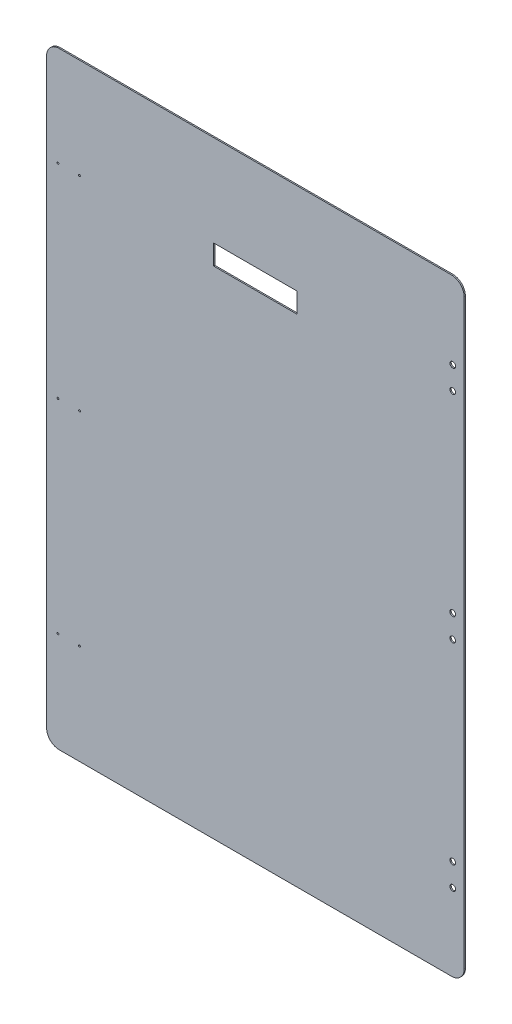
ISO-10303-21;
HEADER;
FILE_DESCRIPTION(('STEP AP214'),'2;1');
FILE_NAME('part.step','',(''),(''),'','','');
FILE_SCHEMA(('AUTOMOTIVE_DESIGN { 1 0 10303 214 1 1 1 1 }'));
ENDSEC;
DATA;
#1=APPLICATION_CONTEXT('core data for automotive mechanical design processes');
#2=APPLICATION_PROTOCOL_DEFINITION('international standard','automotive_design',2000,#1);
#3=PRODUCT_CONTEXT('',#1,'mechanical');
#4=PRODUCT('Part','Part','',(#3));
#5=PRODUCT_RELATED_PRODUCT_CATEGORY('part','',(#4));
#6=PRODUCT_DEFINITION_FORMATION('','',#4);
#7=PRODUCT_DEFINITION_CONTEXT('part definition',#1,'design');
#8=PRODUCT_DEFINITION('design','',#6,#7);
#9=PRODUCT_DEFINITION_SHAPE('','',#8);
#10=(LENGTH_UNIT() NAMED_UNIT(*) SI_UNIT(.MILLI.,.METRE.));
#11=(NAMED_UNIT(*) PLANE_ANGLE_UNIT() SI_UNIT($,.RADIAN.));
#12=(NAMED_UNIT(*) SI_UNIT($,.STERADIAN.) SOLID_ANGLE_UNIT());
#13=UNCERTAINTY_MEASURE_WITH_UNIT(LENGTH_MEASURE(1.E-05),#10,'distance_accuracy_value','');
#14=(GEOMETRIC_REPRESENTATION_CONTEXT(3) GLOBAL_UNCERTAINTY_ASSIGNED_CONTEXT((#13)) GLOBAL_UNIT_ASSIGNED_CONTEXT((#10,
#11,#12)) REPRESENTATION_CONTEXT('',''));
#15=CARTESIAN_POINT('',(0.,0.,0.));
#16=DIRECTION('',(0.,0.,1.));
#17=DIRECTION('',(1.,0.,0.));
#18=AXIS2_PLACEMENT_3D('',#15,#16,#17);
#19=CARTESIAN_POINT('',(-310.,-460.,-2.));
#20=DIRECTION('',(0.,0.,1.));
#21=DIRECTION('',(1.,0.,0.));
#22=AXIS2_PLACEMENT_3D('',#19,#20,#21);
#23=CYLINDRICAL_SURFACE('',#22,20.);
#24=CARTESIAN_POINT('',(-310.,-460.,0.));
#25=DIRECTION('',(0.,0.,1.));
#26=DIRECTION('',(-1.,0.,0.));
#27=AXIS2_PLACEMENT_3D('',#24,#25,#26);
#28=CIRCLE('',#27,20.);
#29=CARTESIAN_POINT('',(-330.,-460.,0.));
#30=VERTEX_POINT('',#29);
#31=CARTESIAN_POINT('',(-310.,-480.,0.));
#32=VERTEX_POINT('',#31);
#33=EDGE_CURVE('E213',#30,#32,#28,.T.);
#34=ORIENTED_EDGE('',*,*,#33,.F.);
#35=DIRECTION('',(0.,0.,1.));
#36=VECTOR('',#35,1.);
#37=CARTESIAN_POINT('',(-330.,-460.,-2.));
#38=LINE('',#37,#36);
#39=CARTESIAN_POINT('',(-330.,-460.,-2.));
#40=VERTEX_POINT('',#39);
#41=EDGE_CURVE('E11',#40,#30,#38,.T.);
#42=ORIENTED_EDGE('',*,*,#41,.F.);
#43=CARTESIAN_POINT('',(-310.,-460.,-2.));
#44=DIRECTION('',(0.,0.,1.));
#45=DIRECTION('',(-1.,0.,0.));
#46=AXIS2_PLACEMENT_3D('',#43,#44,#45);
#47=CIRCLE('',#46,20.);
#48=CARTESIAN_POINT('',(-310.,-480.,-2.));
#49=VERTEX_POINT('',#48);
#50=EDGE_CURVE('E214',#40,#49,#47,.T.);
#51=ORIENTED_EDGE('',*,*,#50,.T.);
#52=DIRECTION('',(0.,0.,1.));
#53=VECTOR('',#52,1.);
#54=CARTESIAN_POINT('',(-310.,-480.,-2.));
#55=LINE('',#54,#53);
#56=EDGE_CURVE('E45',#49,#32,#55,.T.);
#57=ORIENTED_EDGE('',*,*,#56,.T.);
#58=EDGE_LOOP('',(#34,#42,#51,#57));
#59=FACE_BOUND('',#58,.T.);
#60=ADVANCED_FACE('F42',(#59),#23,.T.);
#61=CARTESIAN_POINT('',(-330.,-460.,-2.));
#62=DIRECTION('',(-1.,0.,0.));
#63=DIRECTION('',(0.,0.,1.));
#64=AXIS2_PLACEMENT_3D('',#61,#62,#63);
#65=PLANE('',#64);
#66=DIRECTION('',(0.,-1.,0.));
#67=VECTOR('',#66,1.);
#68=CARTESIAN_POINT('',(-330.,-460.,0.));
#69=LINE('',#68,#67);
#70=CARTESIAN_POINT('',(-330.,460.,0.));
#71=VERTEX_POINT('',#70);
#72=EDGE_CURVE('E218',#71,#30,#69,.T.);
#73=ORIENTED_EDGE('',*,*,#72,.F.);
#74=DIRECTION('',(0.,0.,1.));
#75=VECTOR('',#74,1.);
#76=CARTESIAN_POINT('',(-330.,460.,-2.));
#77=LINE('',#76,#75);
#78=CARTESIAN_POINT('',(-330.,460.,-2.));
#79=VERTEX_POINT('',#78);
#80=EDGE_CURVE('E50',#79,#71,#77,.T.);
#81=ORIENTED_EDGE('',*,*,#80,.F.);
#82=DIRECTION('',(0.,-1.,0.));
#83=VECTOR('',#82,1.);
#84=CARTESIAN_POINT('',(-330.,-460.,-2.));
#85=LINE('',#84,#83);
#86=EDGE_CURVE('E236',#79,#40,#85,.T.);
#87=ORIENTED_EDGE('',*,*,#86,.T.);
#88=ORIENTED_EDGE('',*,*,#41,.T.);
#89=EDGE_LOOP('',(#73,#81,#87,#88));
#90=FACE_BOUND('',#89,.T.);
#91=ADVANCED_FACE('F283',(#90),#65,.T.);
#92=CARTESIAN_POINT('',(-310.,460.,-2.));
#93=DIRECTION('',(0.,0.,1.));
#94=DIRECTION('',(1.,0.,0.));
#95=AXIS2_PLACEMENT_3D('',#92,#93,#94);
#96=CYLINDRICAL_SURFACE('',#95,20.);
#97=CARTESIAN_POINT('',(-310.,460.,0.));
#98=DIRECTION('',(0.,0.,1.));
#99=DIRECTION('',(1.,0.,0.));
#100=AXIS2_PLACEMENT_3D('',#97,#98,#99);
#101=CIRCLE('',#100,20.);
#102=CARTESIAN_POINT('',(-310.,480.,0.));
#103=VERTEX_POINT('',#102);
#104=EDGE_CURVE('E256',#103,#71,#101,.T.);
#105=ORIENTED_EDGE('',*,*,#104,.F.);
#106=DIRECTION('',(0.,0.,1.));
#107=VECTOR('',#106,1.);
#108=CARTESIAN_POINT('',(-310.,480.,-2.));
#109=LINE('',#108,#107);
#110=CARTESIAN_POINT('',(-310.,480.,-2.));
#111=VERTEX_POINT('',#110);
#112=EDGE_CURVE('E262',#111,#103,#109,.T.);
#113=ORIENTED_EDGE('',*,*,#112,.F.);
#114=CARTESIAN_POINT('',(-310.,460.,-2.));
#115=DIRECTION('',(0.,0.,1.));
#116=DIRECTION('',(1.,0.,0.));
#117=AXIS2_PLACEMENT_3D('',#114,#115,#116);
#118=CIRCLE('',#117,20.);
#119=EDGE_CURVE('E233',#111,#79,#118,.T.);
#120=ORIENTED_EDGE('',*,*,#119,.T.);
#121=ORIENTED_EDGE('',*,*,#80,.T.);
#122=EDGE_LOOP('',(#105,#113,#120,#121));
#123=FACE_BOUND('',#122,.T.);
#124=ADVANCED_FACE('F303',(#123),#96,.T.);
#125=CARTESIAN_POINT('',(310.,480.,-2.));
#126=DIRECTION('',(0.,1.,0.));
#127=DIRECTION('',(-1.,0.,0.));
#128=AXIS2_PLACEMENT_3D('',#125,#126,#127);
#129=PLANE('',#128);
#130=DIRECTION('',(-1.,0.,0.));
#131=VECTOR('',#130,1.);
#132=CARTESIAN_POINT('',(310.,480.,0.));
#133=LINE('',#132,#131);
#134=CARTESIAN_POINT('',(310.,480.,0.));
#135=VERTEX_POINT('',#134);
#136=EDGE_CURVE('E253',#135,#103,#133,.T.);
#137=ORIENTED_EDGE('',*,*,#136,.F.);
#138=DIRECTION('',(0.,0.,1.));
#139=VECTOR('',#138,1.);
#140=CARTESIAN_POINT('',(310.,480.,-2.));
#141=LINE('',#140,#139);
#142=CARTESIAN_POINT('',(310.,480.,-2.));
#143=VERTEX_POINT('',#142);
#144=EDGE_CURVE('E264',#143,#135,#141,.T.);
#145=ORIENTED_EDGE('',*,*,#144,.F.);
#146=DIRECTION('',(-1.,0.,0.));
#147=VECTOR('',#146,1.);
#148=CARTESIAN_POINT('',(310.,480.,-2.));
#149=LINE('',#148,#147);
#150=EDGE_CURVE('E230',#143,#111,#149,.T.);
#151=ORIENTED_EDGE('',*,*,#150,.T.);
#152=ORIENTED_EDGE('',*,*,#112,.T.);
#153=EDGE_LOOP('',(#137,#145,#151,#152));
#154=FACE_BOUND('',#153,.T.);
#155=ADVANCED_FACE('F301',(#154),#129,.T.);
#156=CARTESIAN_POINT('',(310.,460.,-2.));
#157=DIRECTION('',(0.,0.,1.));
#158=DIRECTION('',(1.,0.,0.));
#159=AXIS2_PLACEMENT_3D('',#156,#157,#158);
#160=CYLINDRICAL_SURFACE('',#159,20.);
#161=CARTESIAN_POINT('',(310.,460.,0.));
#162=DIRECTION('',(0.,0.,1.));
#163=DIRECTION('',(1.,0.,0.));
#164=AXIS2_PLACEMENT_3D('',#161,#162,#163);
#165=CIRCLE('',#164,20.);
#166=CARTESIAN_POINT('',(330.,460.,0.));
#167=VERTEX_POINT('',#166);
#168=EDGE_CURVE('E250',#167,#135,#165,.T.);
#169=ORIENTED_EDGE('',*,*,#168,.F.);
#170=DIRECTION('',(0.,0.,1.));
#171=VECTOR('',#170,1.);
#172=CARTESIAN_POINT('',(330.,460.,-2.));
#173=LINE('',#172,#171);
#174=CARTESIAN_POINT('',(330.,460.,-2.));
#175=VERTEX_POINT('',#174);
#176=EDGE_CURVE('E266',#175,#167,#173,.T.);
#177=ORIENTED_EDGE('',*,*,#176,.F.);
#178=CARTESIAN_POINT('',(310.,460.,-2.));
#179=DIRECTION('',(0.,0.,1.));
#180=DIRECTION('',(1.,0.,0.));
#181=AXIS2_PLACEMENT_3D('',#178,#179,#180);
#182=CIRCLE('',#181,20.);
#183=EDGE_CURVE('E227',#175,#143,#182,.T.);
#184=ORIENTED_EDGE('',*,*,#183,.T.);
#185=ORIENTED_EDGE('',*,*,#144,.T.);
#186=EDGE_LOOP('',(#169,#177,#184,#185));
#187=FACE_BOUND('',#186,.T.);
#188=ADVANCED_FACE('F297',(#187),#160,.T.);
#189=CARTESIAN_POINT('',(330.,-460.,-2.));
#190=DIRECTION('',(1.,0.,0.));
#191=DIRECTION('',(0.,0.,-1.));
#192=AXIS2_PLACEMENT_3D('',#189,#190,#191);
#193=PLANE('',#192);
#194=DIRECTION('',(0.,1.,0.));
#195=VECTOR('',#194,1.);
#196=CARTESIAN_POINT('',(330.,-460.,0.));
#197=LINE('',#196,#195);
#198=CARTESIAN_POINT('',(330.,-460.,0.));
#199=VERTEX_POINT('',#198);
#200=EDGE_CURVE('E247',#199,#167,#197,.T.);
#201=ORIENTED_EDGE('',*,*,#200,.F.);
#202=DIRECTION('',(0.,0.,1.));
#203=VECTOR('',#202,1.);
#204=CARTESIAN_POINT('',(330.,-460.,-2.));
#205=LINE('',#204,#203);
#206=CARTESIAN_POINT('',(330.,-460.,-2.));
#207=VERTEX_POINT('',#206);
#208=EDGE_CURVE('E268',#207,#199,#205,.T.);
#209=ORIENTED_EDGE('',*,*,#208,.F.);
#210=DIRECTION('',(0.,1.,0.));
#211=VECTOR('',#210,1.);
#212=CARTESIAN_POINT('',(330.,-460.,-2.));
#213=LINE('',#212,#211);
#214=EDGE_CURVE('E224',#207,#175,#213,.T.);
#215=ORIENTED_EDGE('',*,*,#214,.T.);
#216=ORIENTED_EDGE('',*,*,#176,.T.);
#217=EDGE_LOOP('',(#201,#209,#215,#216));
#218=FACE_BOUND('',#217,.T.);
#219=ADVANCED_FACE('F295',(#218),#193,.T.);
#220=CARTESIAN_POINT('',(310.,-460.,-2.));
#221=DIRECTION('',(0.,0.,1.));
#222=DIRECTION('',(1.,0.,0.));
#223=AXIS2_PLACEMENT_3D('',#220,#221,#222);
#224=CYLINDRICAL_SURFACE('',#223,20.);
#225=CARTESIAN_POINT('',(310.,-460.,0.));
#226=DIRECTION('',(0.,0.,1.));
#227=DIRECTION('',(1.,0.,0.));
#228=AXIS2_PLACEMENT_3D('',#225,#226,#227);
#229=CIRCLE('',#228,20.);
#230=CARTESIAN_POINT('',(310.,-480.,0.));
#231=VERTEX_POINT('',#230);
#232=EDGE_CURVE('E244',#231,#199,#229,.T.);
#233=ORIENTED_EDGE('',*,*,#232,.F.);
#234=DIRECTION('',(0.,0.,1.));
#235=VECTOR('',#234,1.);
#236=CARTESIAN_POINT('',(310.,-480.,-2.));
#237=LINE('',#236,#235);
#238=CARTESIAN_POINT('',(310.,-480.,-2.));
#239=VERTEX_POINT('',#238);
#240=EDGE_CURVE('E269',#239,#231,#237,.T.);
#241=ORIENTED_EDGE('',*,*,#240,.F.);
#242=CARTESIAN_POINT('',(310.,-460.,-2.));
#243=DIRECTION('',(0.,0.,1.));
#244=DIRECTION('',(1.,0.,0.));
#245=AXIS2_PLACEMENT_3D('',#242,#243,#244);
#246=CIRCLE('',#245,20.);
#247=EDGE_CURVE('E221',#239,#207,#246,.T.);
#248=ORIENTED_EDGE('',*,*,#247,.T.);
#249=ORIENTED_EDGE('',*,*,#208,.T.);
#250=EDGE_LOOP('',(#233,#241,#248,#249));
#251=FACE_BOUND('',#250,.T.);
#252=ADVANCED_FACE('F291',(#251),#224,.T.);
#253=CARTESIAN_POINT('',(310.,-480.,-2.));
#254=DIRECTION('',(0.,-1.,0.));
#255=DIRECTION('',(1.,0.,0.));
#256=AXIS2_PLACEMENT_3D('',#253,#254,#255);
#257=PLANE('',#256);
#258=DIRECTION('',(1.,0.,0.));
#259=VECTOR('',#258,1.);
#260=CARTESIAN_POINT('',(310.,-480.,0.));
#261=LINE('',#260,#259);
#262=EDGE_CURVE('E241',#32,#231,#261,.T.);
#263=ORIENTED_EDGE('',*,*,#262,.F.);
#264=ORIENTED_EDGE('',*,*,#56,.F.);
#265=DIRECTION('',(1.,0.,0.));
#266=VECTOR('',#265,1.);
#267=CARTESIAN_POINT('',(310.,-480.,-2.));
#268=LINE('',#267,#266);
#269=EDGE_CURVE('E217',#49,#239,#268,.T.);
#270=ORIENTED_EDGE('',*,*,#269,.T.);
#271=ORIENTED_EDGE('',*,*,#240,.T.);
#272=EDGE_LOOP('',(#263,#264,#270,#271));
#273=FACE_BOUND('',#272,.T.);
#274=ADVANCED_FACE('F277',(#273),#257,.T.);
#275=CARTESIAN_POINT('',(-310.,-460.,-2.));
#276=DIRECTION('',(0.,0.,-1.));
#277=DIRECTION('',(-1.,0.,0.));
#278=AXIS2_PLACEMENT_3D('',#275,#276,#277);
#279=PLANE('',#278);
#280=CARTESIAN_POINT('',(-311.999999662489,322.,-2.));
#281=DIRECTION('',(0.,0.,1.));
#282=DIRECTION('',(1.,0.,0.));
#283=AXIS2_PLACEMENT_3D('',#280,#281,#282);
#284=CIRCLE('',#283,1.45000000000001);
#285=CARTESIAN_POINT('',(-310.549999662489,322.,-2.));
#286=VERTEX_POINT('',#285);
#287=EDGE_CURVE('E553',#286,#286,#284,.T.);
#288=ORIENTED_EDGE('',*,*,#287,.T.);
#289=EDGE_LOOP('',(#288));
#290=FACE_BOUND('',#289,.T.);
#291=CARTESIAN_POINT('',(-277.999999662489,322.,-2.));
#292=DIRECTION('',(0.,0.,1.));
#293=DIRECTION('',(1.,0.,0.));
#294=AXIS2_PLACEMENT_3D('',#291,#292,#293);
#295=CIRCLE('',#294,1.45000000000001);
#296=CARTESIAN_POINT('',(-276.549999662489,322.,-2.));
#297=VERTEX_POINT('',#296);
#298=EDGE_CURVE('E563',#297,#297,#295,.T.);
#299=ORIENTED_EDGE('',*,*,#298,.T.);
#300=EDGE_LOOP('',(#299));
#301=FACE_BOUND('',#300,.T.);
#302=CARTESIAN_POINT('',(-311.999999662489,0.,-2.));
#303=DIRECTION('',(0.,0.,1.));
#304=DIRECTION('',(1.,0.,0.));
#305=AXIS2_PLACEMENT_3D('',#302,#303,#304);
#306=CIRCLE('',#305,1.45000000000001);
#307=CARTESIAN_POINT('',(-310.549999662489,0.,-2.));
#308=VERTEX_POINT('',#307);
#309=EDGE_CURVE('E569',#308,#308,#306,.T.);
#310=ORIENTED_EDGE('',*,*,#309,.T.);
#311=EDGE_LOOP('',(#310));
#312=FACE_BOUND('',#311,.T.);
#313=CARTESIAN_POINT('',(-277.999999662489,0.,-2.));
#314=DIRECTION('',(0.,0.,1.));
#315=DIRECTION('',(1.,0.,0.));
#316=AXIS2_PLACEMENT_3D('',#313,#314,#315);
#317=CIRCLE('',#316,1.45000000000001);
#318=CARTESIAN_POINT('',(-276.549999662489,0.,-2.));
#319=VERTEX_POINT('',#318);
#320=EDGE_CURVE('E575',#319,#319,#317,.T.);
#321=ORIENTED_EDGE('',*,*,#320,.T.);
#322=EDGE_LOOP('',(#321));
#323=FACE_BOUND('',#322,.T.);
#324=CARTESIAN_POINT('',(-311.999999662489,-322.,-2.));
#325=DIRECTION('',(0.,0.,1.));
#326=DIRECTION('',(1.,0.,0.));
#327=AXIS2_PLACEMENT_3D('',#324,#325,#326);
#328=CIRCLE('',#327,1.45000000000001);
#329=CARTESIAN_POINT('',(-310.549999662489,-322.,-2.));
#330=VERTEX_POINT('',#329);
#331=EDGE_CURVE('E581',#330,#330,#328,.T.);
#332=ORIENTED_EDGE('',*,*,#331,.T.);
#333=EDGE_LOOP('',(#332));
#334=FACE_BOUND('',#333,.T.);
#335=CARTESIAN_POINT('',(-277.999999662489,-322.,-2.));
#336=DIRECTION('',(0.,0.,1.));
#337=DIRECTION('',(1.,0.,0.));
#338=AXIS2_PLACEMENT_3D('',#335,#336,#337);
#339=CIRCLE('',#338,1.45000000000001);
#340=CARTESIAN_POINT('',(-276.549999662489,-322.,-2.));
#341=VERTEX_POINT('',#340);
#342=EDGE_CURVE('E160',#341,#341,#339,.T.);
#343=ORIENTED_EDGE('',*,*,#342,.T.);
#344=EDGE_LOOP('',(#343));
#345=FACE_BOUND('',#344,.T.);
#346=DIRECTION('',(0.,-1.,0.));
#347=VECTOR('',#346,1.);
#348=CARTESIAN_POINT('',(-66.0000000000001,304.15,-2.));
#349=LINE('',#348,#347);
#350=CARTESIAN_POINT('',(-66.0000000000001,335.85,-2.));
#351=VERTEX_POINT('',#350);
#352=CARTESIAN_POINT('',(-66.0000000000001,304.15,-2.));
#353=VERTEX_POINT('',#352);
#354=EDGE_CURVE('E135',#351,#353,#349,.T.);
#355=ORIENTED_EDGE('',*,*,#354,.T.);
#356=DIRECTION('',(1.,0.,0.));
#357=VECTOR('',#356,1.);
#358=CARTESIAN_POINT('',(65.9999999999999,304.15,-2.));
#359=LINE('',#358,#357);
#360=CARTESIAN_POINT('',(66.,304.15,-2.));
#361=VERTEX_POINT('',#360);
#362=EDGE_CURVE('E145',#353,#361,#359,.T.);
#363=ORIENTED_EDGE('',*,*,#362,.T.);
#364=DIRECTION('',(0.,1.,0.));
#365=VECTOR('',#364,1.);
#366=CARTESIAN_POINT('',(65.9999999999999,304.15,-2.));
#367=LINE('',#366,#365);
#368=CARTESIAN_POINT('',(65.9999999999999,335.85,-2.));
#369=VERTEX_POINT('',#368);
#370=EDGE_CURVE('E58',#361,#369,#367,.T.);
#371=ORIENTED_EDGE('',*,*,#370,.T.);
#372=DIRECTION('',(-1.,0.,0.));
#373=VECTOR('',#372,1.);
#374=CARTESIAN_POINT('',(65.9999999999999,335.85,-2.));
#375=LINE('',#374,#373);
#376=EDGE_CURVE('E142',#369,#351,#375,.T.);
#377=ORIENTED_EDGE('',*,*,#376,.T.);
#378=EDGE_LOOP('',(#355,#363,#371,#377));
#379=FACE_BOUND('',#378,.T.);
#380=CARTESIAN_POINT('',(312.,358.,-2.));
#381=DIRECTION('',(0.,0.,1.));
#382=DIRECTION('',(1.,0.,0.));
#383=AXIS2_PLACEMENT_3D('',#380,#381,#382);
#384=CIRCLE('',#383,4.5);
#385=CARTESIAN_POINT('',(316.5,358.,-2.));
#386=VERTEX_POINT('',#385);
#387=EDGE_CURVE('E180',#386,#386,#384,.T.);
#388=ORIENTED_EDGE('',*,*,#387,.T.);
#389=EDGE_LOOP('',(#388));
#390=FACE_BOUND('',#389,.T.);
#391=CARTESIAN_POINT('',(312.,322.,-2.));
#392=DIRECTION('',(0.,0.,1.));
#393=DIRECTION('',(1.,0.,0.));
#394=AXIS2_PLACEMENT_3D('',#391,#392,#393);
#395=CIRCLE('',#394,4.5);
#396=CARTESIAN_POINT('',(316.5,322.,-2.));
#397=VERTEX_POINT('',#396);
#398=EDGE_CURVE('E186',#397,#397,#395,.T.);
#399=ORIENTED_EDGE('',*,*,#398,.T.);
#400=EDGE_LOOP('',(#399));
#401=FACE_BOUND('',#400,.T.);
#402=CARTESIAN_POINT('',(312.,17.9999999999998,-2.));
#403=DIRECTION('',(0.,0.,1.));
#404=DIRECTION('',(1.,0.,0.));
#405=AXIS2_PLACEMENT_3D('',#402,#403,#404);
#406=CIRCLE('',#405,4.5);
#407=CARTESIAN_POINT('',(316.5,17.9999999999998,-2.));
#408=VERTEX_POINT('',#407);
#409=EDGE_CURVE('E192',#408,#408,#406,.T.);
#410=ORIENTED_EDGE('',*,*,#409,.T.);
#411=EDGE_LOOP('',(#410));
#412=FACE_BOUND('',#411,.T.);
#413=CARTESIAN_POINT('',(312.,-18.0000000000002,-2.));
#414=DIRECTION('',(0.,0.,1.));
#415=DIRECTION('',(1.,0.,0.));
#416=AXIS2_PLACEMENT_3D('',#413,#414,#415);
#417=CIRCLE('',#416,4.5);
#418=CARTESIAN_POINT('',(316.5,-18.0000000000002,-2.));
#419=VERTEX_POINT('',#418);
#420=EDGE_CURVE('E198',#419,#419,#417,.T.);
#421=ORIENTED_EDGE('',*,*,#420,.T.);
#422=EDGE_LOOP('',(#421));
#423=FACE_BOUND('',#422,.T.);
#424=CARTESIAN_POINT('',(312.,-322.,-2.));
#425=DIRECTION('',(0.,0.,1.));
#426=DIRECTION('',(1.,0.,0.));
#427=AXIS2_PLACEMENT_3D('',#424,#425,#426);
#428=CIRCLE('',#427,4.5);
#429=CARTESIAN_POINT('',(316.5,-322.,-2.));
#430=VERTEX_POINT('',#429);
#431=EDGE_CURVE('E204',#430,#430,#428,.T.);
#432=ORIENTED_EDGE('',*,*,#431,.T.);
#433=EDGE_LOOP('',(#432));
#434=FACE_BOUND('',#433,.T.);
#435=CARTESIAN_POINT('',(312.,-358.,-2.));
#436=DIRECTION('',(0.,0.,1.));
#437=DIRECTION('',(1.,0.,0.));
#438=AXIS2_PLACEMENT_3D('',#435,#436,#437);
#439=CIRCLE('',#438,4.5);
#440=CARTESIAN_POINT('',(316.5,-358.,-2.));
#441=VERTEX_POINT('',#440);
#442=EDGE_CURVE('E210',#441,#441,#439,.T.);
#443=ORIENTED_EDGE('',*,*,#442,.T.);
#444=EDGE_LOOP('',(#443));
#445=FACE_BOUND('',#444,.T.);
#446=ORIENTED_EDGE('',*,*,#50,.F.);
#447=ORIENTED_EDGE('',*,*,#86,.F.);
#448=ORIENTED_EDGE('',*,*,#119,.F.);
#449=ORIENTED_EDGE('',*,*,#150,.F.);
#450=ORIENTED_EDGE('',*,*,#183,.F.);
#451=ORIENTED_EDGE('',*,*,#214,.F.);
#452=ORIENTED_EDGE('',*,*,#247,.F.);
#453=ORIENTED_EDGE('',*,*,#269,.F.);
#454=EDGE_LOOP('',(#446,#447,#448,#449,#450,#451,#452,#453));
#455=FACE_BOUND('',#454,.T.);
#456=ADVANCED_FACE('F150',(#290,#301,#312,#323,#334,#345,#379,#390,#401,#412,#423,#434,#445,
#455),#279,.T.);
#457=CARTESIAN_POINT('',(-310.,-460.,0.));
#458=DIRECTION('',(0.,0.,-1.));
#459=DIRECTION('',(-1.,0.,0.));
#460=AXIS2_PLACEMENT_3D('',#457,#458,#459);
#461=PLANE('',#460);
#462=CARTESIAN_POINT('',(-311.999999662489,322.,0.));
#463=DIRECTION('',(0.,0.,1.));
#464=DIRECTION('',(1.,0.,0.));
#465=AXIS2_PLACEMENT_3D('',#462,#463,#464);
#466=CIRCLE('',#465,1.45000000000001);
#467=CARTESIAN_POINT('',(-310.549999662489,322.,0.));
#468=VERTEX_POINT('',#467);
#469=EDGE_CURVE('E556',#468,#468,#466,.T.);
#470=ORIENTED_EDGE('',*,*,#469,.F.);
#471=EDGE_LOOP('',(#470));
#472=FACE_BOUND('',#471,.T.);
#473=CARTESIAN_POINT('',(-277.999999662489,322.,0.));
#474=DIRECTION('',(0.,0.,1.));
#475=DIRECTION('',(1.,0.,0.));
#476=AXIS2_PLACEMENT_3D('',#473,#474,#475);
#477=CIRCLE('',#476,1.45000000000001);
#478=CARTESIAN_POINT('',(-276.549999662489,322.,0.));
#479=VERTEX_POINT('',#478);
#480=EDGE_CURVE('E558',#479,#479,#477,.T.);
#481=ORIENTED_EDGE('',*,*,#480,.F.);
#482=EDGE_LOOP('',(#481));
#483=FACE_BOUND('',#482,.T.);
#484=CARTESIAN_POINT('',(-311.999999662489,0.,0.));
#485=DIRECTION('',(0.,0.,1.));
#486=DIRECTION('',(1.,0.,0.));
#487=AXIS2_PLACEMENT_3D('',#484,#485,#486);
#488=CIRCLE('',#487,1.45000000000001);
#489=CARTESIAN_POINT('',(-310.549999662489,0.,0.));
#490=VERTEX_POINT('',#489);
#491=EDGE_CURVE('E566',#490,#490,#488,.T.);
#492=ORIENTED_EDGE('',*,*,#491,.F.);
#493=EDGE_LOOP('',(#492));
#494=FACE_BOUND('',#493,.T.);
#495=CARTESIAN_POINT('',(-277.999999662489,0.,0.));
#496=DIRECTION('',(0.,0.,1.));
#497=DIRECTION('',(1.,0.,0.));
#498=AXIS2_PLACEMENT_3D('',#495,#496,#497);
#499=CIRCLE('',#498,1.45000000000001);
#500=CARTESIAN_POINT('',(-276.549999662489,0.,0.));
#501=VERTEX_POINT('',#500);
#502=EDGE_CURVE('E572',#501,#501,#499,.T.);
#503=ORIENTED_EDGE('',*,*,#502,.F.);
#504=EDGE_LOOP('',(#503));
#505=FACE_BOUND('',#504,.T.);
#506=CARTESIAN_POINT('',(-311.999999662489,-322.,0.));
#507=DIRECTION('',(0.,0.,1.));
#508=DIRECTION('',(1.,0.,0.));
#509=AXIS2_PLACEMENT_3D('',#506,#507,#508);
#510=CIRCLE('',#509,1.45000000000001);
#511=CARTESIAN_POINT('',(-310.549999662489,-322.,0.));
#512=VERTEX_POINT('',#511);
#513=EDGE_CURVE('E578',#512,#512,#510,.T.);
#514=ORIENTED_EDGE('',*,*,#513,.F.);
#515=EDGE_LOOP('',(#514));
#516=FACE_BOUND('',#515,.T.);
#517=CARTESIAN_POINT('',(-277.999999662489,-322.,0.));
#518=DIRECTION('',(0.,0.,1.));
#519=DIRECTION('',(1.,0.,0.));
#520=AXIS2_PLACEMENT_3D('',#517,#518,#519);
#521=CIRCLE('',#520,1.45000000000001);
#522=CARTESIAN_POINT('',(-276.549999662489,-322.,0.));
#523=VERTEX_POINT('',#522);
#524=EDGE_CURVE('E583',#523,#523,#521,.T.);
#525=ORIENTED_EDGE('',*,*,#524,.F.);
#526=EDGE_LOOP('',(#525));
#527=FACE_BOUND('',#526,.T.);
#528=DIRECTION('',(1.,0.,0.));
#529=VECTOR('',#528,1.);
#530=CARTESIAN_POINT('',(65.9999999999999,304.15,0.));
#531=LINE('',#530,#529);
#532=CARTESIAN_POINT('',(-66.0000000000001,304.15,0.));
#533=VERTEX_POINT('',#532);
#534=CARTESIAN_POINT('',(65.9999999999999,304.15,0.));
#535=VERTEX_POINT('',#534);
#536=EDGE_CURVE('E167',#533,#535,#531,.T.);
#537=ORIENTED_EDGE('',*,*,#536,.F.);
#538=DIRECTION('',(0.,-1.,0.));
#539=VECTOR('',#538,1.);
#540=CARTESIAN_POINT('',(-66.0000000000001,304.15,0.));
#541=LINE('',#540,#539);
#542=CARTESIAN_POINT('',(-66.0000000000001,335.85,0.));
#543=VERTEX_POINT('',#542);
#544=EDGE_CURVE('E68',#543,#533,#541,.T.);
#545=ORIENTED_EDGE('',*,*,#544,.F.);
#546=DIRECTION('',(-1.,0.,0.));
#547=VECTOR('',#546,1.);
#548=CARTESIAN_POINT('',(65.9999999999999,335.85,0.));
#549=LINE('',#548,#547);
#550=CARTESIAN_POINT('',(65.9999999999999,335.85,0.));
#551=VERTEX_POINT('',#550);
#552=EDGE_CURVE('E154',#551,#543,#549,.T.);
#553=ORIENTED_EDGE('',*,*,#552,.F.);
#554=DIRECTION('',(0.,1.,0.));
#555=VECTOR('',#554,1.);
#556=CARTESIAN_POINT('',(65.9999999999999,304.15,0.));
#557=LINE('',#556,#555);
#558=EDGE_CURVE('E157',#535,#551,#557,.T.);
#559=ORIENTED_EDGE('',*,*,#558,.F.);
#560=EDGE_LOOP('',(#537,#545,#553,#559));
#561=FACE_BOUND('',#560,.T.);
#562=CARTESIAN_POINT('',(312.,358.,0.));
#563=DIRECTION('',(0.,0.,1.));
#564=DIRECTION('',(1.,0.,0.));
#565=AXIS2_PLACEMENT_3D('',#562,#563,#564);
#566=CIRCLE('',#565,4.5);
#567=CARTESIAN_POINT('',(316.5,358.,0.));
#568=VERTEX_POINT('',#567);
#569=EDGE_CURVE('E174',#568,#568,#566,.T.);
#570=ORIENTED_EDGE('',*,*,#569,.F.);
#571=EDGE_LOOP('',(#570));
#572=FACE_BOUND('',#571,.T.);
#573=CARTESIAN_POINT('',(312.,322.,0.));
#574=DIRECTION('',(0.,0.,1.));
#575=DIRECTION('',(1.,0.,0.));
#576=AXIS2_PLACEMENT_3D('',#573,#574,#575);
#577=CIRCLE('',#576,4.5);
#578=CARTESIAN_POINT('',(316.5,322.,0.));
#579=VERTEX_POINT('',#578);
#580=EDGE_CURVE('E183',#579,#579,#577,.T.);
#581=ORIENTED_EDGE('',*,*,#580,.F.);
#582=EDGE_LOOP('',(#581));
#583=FACE_BOUND('',#582,.T.);
#584=CARTESIAN_POINT('',(312.,17.9999999999998,0.));
#585=DIRECTION('',(0.,0.,1.));
#586=DIRECTION('',(1.,0.,0.));
#587=AXIS2_PLACEMENT_3D('',#584,#585,#586);
#588=CIRCLE('',#587,4.5);
#589=CARTESIAN_POINT('',(316.5,17.9999999999998,0.));
#590=VERTEX_POINT('',#589);
#591=EDGE_CURVE('E189',#590,#590,#588,.T.);
#592=ORIENTED_EDGE('',*,*,#591,.F.);
#593=EDGE_LOOP('',(#592));
#594=FACE_BOUND('',#593,.T.);
#595=CARTESIAN_POINT('',(312.,-18.0000000000002,0.));
#596=DIRECTION('',(0.,0.,1.));
#597=DIRECTION('',(1.,0.,0.));
#598=AXIS2_PLACEMENT_3D('',#595,#596,#597);
#599=CIRCLE('',#598,4.5);
#600=CARTESIAN_POINT('',(316.5,-18.0000000000002,0.));
#601=VERTEX_POINT('',#600);
#602=EDGE_CURVE('E195',#601,#601,#599,.T.);
#603=ORIENTED_EDGE('',*,*,#602,.F.);
#604=EDGE_LOOP('',(#603));
#605=FACE_BOUND('',#604,.T.);
#606=CARTESIAN_POINT('',(312.,-322.,0.));
#607=DIRECTION('',(0.,0.,1.));
#608=DIRECTION('',(1.,0.,0.));
#609=AXIS2_PLACEMENT_3D('',#606,#607,#608);
#610=CIRCLE('',#609,4.5);
#611=CARTESIAN_POINT('',(316.5,-322.,0.));
#612=VERTEX_POINT('',#611);
#613=EDGE_CURVE('E201',#612,#612,#610,.T.);
#614=ORIENTED_EDGE('',*,*,#613,.F.);
#615=EDGE_LOOP('',(#614));
#616=FACE_BOUND('',#615,.T.);
#617=CARTESIAN_POINT('',(312.,-358.,0.));
#618=DIRECTION('',(0.,0.,1.));
#619=DIRECTION('',(1.,0.,0.));
#620=AXIS2_PLACEMENT_3D('',#617,#618,#619);
#621=CIRCLE('',#620,4.5);
#622=CARTESIAN_POINT('',(316.5,-358.,0.));
#623=VERTEX_POINT('',#622);
#624=EDGE_CURVE('E207',#623,#623,#621,.T.);
#625=ORIENTED_EDGE('',*,*,#624,.F.);
#626=EDGE_LOOP('',(#625));
#627=FACE_BOUND('',#626,.T.);
#628=ORIENTED_EDGE('',*,*,#33,.T.);
#629=ORIENTED_EDGE('',*,*,#262,.T.);
#630=ORIENTED_EDGE('',*,*,#232,.T.);
#631=ORIENTED_EDGE('',*,*,#200,.T.);
#632=ORIENTED_EDGE('',*,*,#168,.T.);
#633=ORIENTED_EDGE('',*,*,#136,.T.);
#634=ORIENTED_EDGE('',*,*,#104,.T.);
#635=ORIENTED_EDGE('',*,*,#72,.T.);
#636=EDGE_LOOP('',(#628,#629,#630,#631,#632,#633,#634,#635));
#637=FACE_BOUND('',#636,.T.);
#638=ADVANCED_FACE('F279',(#472,#483,#494,#505,#516,#527,#561,#572,#583,#594,#605,#616,#627,
#637),#461,.F.);
#639=CARTESIAN_POINT('',(312.,-358.,0.));
#640=DIRECTION('',(0.,0.,1.));
#641=DIRECTION('',(1.,0.,0.));
#642=AXIS2_PLACEMENT_3D('',#639,#640,#641);
#643=CYLINDRICAL_SURFACE('',#642,4.5);
#644=ORIENTED_EDGE('',*,*,#442,.F.);
#645=EDGE_LOOP('',(#644));
#646=FACE_BOUND('',#645,.T.);
#647=ORIENTED_EDGE('',*,*,#624,.T.);
#648=EDGE_LOOP('',(#647));
#649=FACE_BOUND('',#648,.T.);
#650=ADVANCED_FACE('F374',(#646,#649),#643,.F.);
#651=CARTESIAN_POINT('',(312.,-322.,0.));
#652=DIRECTION('',(0.,0.,1.));
#653=DIRECTION('',(1.,0.,0.));
#654=AXIS2_PLACEMENT_3D('',#651,#652,#653);
#655=CYLINDRICAL_SURFACE('',#654,4.5);
#656=ORIENTED_EDGE('',*,*,#431,.F.);
#657=EDGE_LOOP('',(#656));
#658=FACE_BOUND('',#657,.T.);
#659=ORIENTED_EDGE('',*,*,#613,.T.);
#660=EDGE_LOOP('',(#659));
#661=FACE_BOUND('',#660,.T.);
#662=ADVANCED_FACE('F379',(#658,#661),#655,.F.);
#663=CARTESIAN_POINT('',(312.,-18.0000000000002,0.));
#664=DIRECTION('',(0.,0.,1.));
#665=DIRECTION('',(1.,0.,0.));
#666=AXIS2_PLACEMENT_3D('',#663,#664,#665);
#667=CYLINDRICAL_SURFACE('',#666,4.5);
#668=ORIENTED_EDGE('',*,*,#420,.F.);
#669=EDGE_LOOP('',(#668));
#670=FACE_BOUND('',#669,.T.);
#671=ORIENTED_EDGE('',*,*,#602,.T.);
#672=EDGE_LOOP('',(#671));
#673=FACE_BOUND('',#672,.T.);
#674=ADVANCED_FACE('F391',(#670,#673),#667,.F.);
#675=CARTESIAN_POINT('',(312.,17.9999999999998,0.));
#676=DIRECTION('',(0.,0.,1.));
#677=DIRECTION('',(1.,0.,0.));
#678=AXIS2_PLACEMENT_3D('',#675,#676,#677);
#679=CYLINDRICAL_SURFACE('',#678,4.5);
#680=ORIENTED_EDGE('',*,*,#409,.F.);
#681=EDGE_LOOP('',(#680));
#682=FACE_BOUND('',#681,.T.);
#683=ORIENTED_EDGE('',*,*,#591,.T.);
#684=EDGE_LOOP('',(#683));
#685=FACE_BOUND('',#684,.T.);
#686=ADVANCED_FACE('F401',(#682,#685),#679,.F.);
#687=CARTESIAN_POINT('',(312.,322.,0.));
#688=DIRECTION('',(0.,0.,1.));
#689=DIRECTION('',(1.,0.,0.));
#690=AXIS2_PLACEMENT_3D('',#687,#688,#689);
#691=CYLINDRICAL_SURFACE('',#690,4.5);
#692=ORIENTED_EDGE('',*,*,#398,.F.);
#693=EDGE_LOOP('',(#692));
#694=FACE_BOUND('',#693,.T.);
#695=ORIENTED_EDGE('',*,*,#580,.T.);
#696=EDGE_LOOP('',(#695));
#697=FACE_BOUND('',#696,.T.);
#698=ADVANCED_FACE('F411',(#694,#697),#691,.F.);
#699=CARTESIAN_POINT('',(312.,358.,0.));
#700=DIRECTION('',(0.,0.,1.));
#701=DIRECTION('',(1.,0.,0.));
#702=AXIS2_PLACEMENT_3D('',#699,#700,#701);
#703=CYLINDRICAL_SURFACE('',#702,4.5);
#704=ORIENTED_EDGE('',*,*,#387,.F.);
#705=EDGE_LOOP('',(#704));
#706=FACE_BOUND('',#705,.T.);
#707=ORIENTED_EDGE('',*,*,#569,.T.);
#708=EDGE_LOOP('',(#707));
#709=FACE_BOUND('',#708,.T.);
#710=ADVANCED_FACE('F421',(#706,#709),#703,.F.);
#711=CARTESIAN_POINT('',(-66.0000000000001,304.15,-2.));
#712=DIRECTION('',(-1.,0.,0.));
#713=DIRECTION('',(0.,0.,1.));
#714=AXIS2_PLACEMENT_3D('',#711,#712,#713);
#715=PLANE('',#714);
#716=ORIENTED_EDGE('',*,*,#544,.T.);
#717=DIRECTION('',(0.,0.,1.));
#718=VECTOR('',#717,1.);
#719=CARTESIAN_POINT('',(-66.0000000000001,304.15,-2.));
#720=LINE('',#719,#718);
#721=EDGE_CURVE('E131',#353,#533,#720,.T.);
#722=ORIENTED_EDGE('',*,*,#721,.F.);
#723=ORIENTED_EDGE('',*,*,#354,.F.);
#724=DIRECTION('',(0.,0.,1.));
#725=VECTOR('',#724,1.);
#726=CARTESIAN_POINT('',(-66.0000000000001,335.85,-2.));
#727=LINE('',#726,#725);
#728=EDGE_CURVE('E172',#351,#543,#727,.T.);
#729=ORIENTED_EDGE('',*,*,#728,.T.);
#730=EDGE_LOOP('',(#716,#722,#723,#729));
#731=FACE_BOUND('',#730,.T.);
#732=ADVANCED_FACE('F133',(#731),#715,.F.);
#733=CARTESIAN_POINT('',(65.9999999999999,335.85,-2.));
#734=DIRECTION('',(0.,1.,0.));
#735=DIRECTION('',(-1.,0.,0.));
#736=AXIS2_PLACEMENT_3D('',#733,#734,#735);
#737=PLANE('',#736);
#738=ORIENTED_EDGE('',*,*,#552,.T.);
#739=ORIENTED_EDGE('',*,*,#728,.F.);
#740=ORIENTED_EDGE('',*,*,#376,.F.);
#741=DIRECTION('',(0.,0.,1.));
#742=VECTOR('',#741,1.);
#743=CARTESIAN_POINT('',(65.9999999999999,335.85,-2.));
#744=LINE('',#743,#742);
#745=EDGE_CURVE('E175',#369,#551,#744,.T.);
#746=ORIENTED_EDGE('',*,*,#745,.T.);
#747=EDGE_LOOP('',(#738,#739,#740,#746));
#748=FACE_BOUND('',#747,.T.);
#749=ADVANCED_FACE('F440',(#748),#737,.F.);
#750=CARTESIAN_POINT('',(65.9999999999999,304.15,-2.));
#751=DIRECTION('',(1.,0.,0.));
#752=DIRECTION('',(0.,0.,-1.));
#753=AXIS2_PLACEMENT_3D('',#750,#751,#752);
#754=PLANE('',#753);
#755=ORIENTED_EDGE('',*,*,#558,.T.);
#756=ORIENTED_EDGE('',*,*,#745,.F.);
#757=ORIENTED_EDGE('',*,*,#370,.F.);
#758=DIRECTION('',(0.,0.,1.));
#759=VECTOR('',#758,1.);
#760=CARTESIAN_POINT('',(65.9999999999999,304.15,-2.));
#761=LINE('',#760,#759);
#762=EDGE_CURVE('E141',#361,#535,#761,.T.);
#763=ORIENTED_EDGE('',*,*,#762,.T.);
#764=EDGE_LOOP('',(#755,#756,#757,#763));
#765=FACE_BOUND('',#764,.T.);
#766=ADVANCED_FACE('F450',(#765),#754,.F.);
#767=CARTESIAN_POINT('',(65.9999999999999,304.15,-2.));
#768=DIRECTION('',(0.,-1.,0.));
#769=DIRECTION('',(0.,0.,-1.));
#770=AXIS2_PLACEMENT_3D('',#767,#768,#769);
#771=PLANE('',#770);
#772=ORIENTED_EDGE('',*,*,#536,.T.);
#773=ORIENTED_EDGE('',*,*,#762,.F.);
#774=ORIENTED_EDGE('',*,*,#362,.F.);
#775=ORIENTED_EDGE('',*,*,#721,.T.);
#776=EDGE_LOOP('',(#772,#773,#774,#775));
#777=FACE_BOUND('',#776,.T.);
#778=ADVANCED_FACE('F146',(#777),#771,.F.);
#779=CARTESIAN_POINT('',(-277.999999662489,-322.,0.));
#780=DIRECTION('',(0.,0.,1.));
#781=DIRECTION('',(1.,0.,0.));
#782=AXIS2_PLACEMENT_3D('',#779,#780,#781);
#783=CYLINDRICAL_SURFACE('',#782,1.45000000000001);
#784=ORIENTED_EDGE('',*,*,#342,.F.);
#785=EDGE_LOOP('',(#784));
#786=FACE_BOUND('',#785,.T.);
#787=ORIENTED_EDGE('',*,*,#524,.T.);
#788=EDGE_LOOP('',(#787));
#789=FACE_BOUND('',#788,.T.);
#790=ADVANCED_FACE('F470',(#786,#789),#783,.F.);
#791=CARTESIAN_POINT('',(-311.999999662489,-322.,0.));
#792=DIRECTION('',(0.,0.,1.));
#793=DIRECTION('',(1.,0.,0.));
#794=AXIS2_PLACEMENT_3D('',#791,#792,#793);
#795=CYLINDRICAL_SURFACE('',#794,1.45000000000001);
#796=ORIENTED_EDGE('',*,*,#331,.F.);
#797=EDGE_LOOP('',(#796));
#798=FACE_BOUND('',#797,.T.);
#799=ORIENTED_EDGE('',*,*,#513,.T.);
#800=EDGE_LOOP('',(#799));
#801=FACE_BOUND('',#800,.T.);
#802=ADVANCED_FACE('F496',(#798,#801),#795,.F.);
#803=CARTESIAN_POINT('',(-277.999999662489,0.,0.));
#804=DIRECTION('',(0.,0.,1.));
#805=DIRECTION('',(1.,0.,0.));
#806=AXIS2_PLACEMENT_3D('',#803,#804,#805);
#807=CYLINDRICAL_SURFACE('',#806,1.45000000000001);
#808=ORIENTED_EDGE('',*,*,#320,.F.);
#809=EDGE_LOOP('',(#808));
#810=FACE_BOUND('',#809,.T.);
#811=ORIENTED_EDGE('',*,*,#502,.T.);
#812=EDGE_LOOP('',(#811));
#813=FACE_BOUND('',#812,.T.);
#814=ADVANCED_FACE('F506',(#810,#813),#807,.F.);
#815=CARTESIAN_POINT('',(-311.999999662489,0.,0.));
#816=DIRECTION('',(0.,0.,1.));
#817=DIRECTION('',(1.,0.,0.));
#818=AXIS2_PLACEMENT_3D('',#815,#816,#817);
#819=CYLINDRICAL_SURFACE('',#818,1.45000000000001);
#820=ORIENTED_EDGE('',*,*,#309,.F.);
#821=EDGE_LOOP('',(#820));
#822=FACE_BOUND('',#821,.T.);
#823=ORIENTED_EDGE('',*,*,#491,.T.);
#824=EDGE_LOOP('',(#823));
#825=FACE_BOUND('',#824,.T.);
#826=ADVANCED_FACE('F516',(#822,#825),#819,.F.);
#827=CARTESIAN_POINT('',(-277.999999662489,322.,0.));
#828=DIRECTION('',(0.,0.,1.));
#829=DIRECTION('',(1.,0.,0.));
#830=AXIS2_PLACEMENT_3D('',#827,#828,#829);
#831=CYLINDRICAL_SURFACE('',#830,1.45000000000001);
#832=ORIENTED_EDGE('',*,*,#298,.F.);
#833=EDGE_LOOP('',(#832));
#834=FACE_BOUND('',#833,.T.);
#835=ORIENTED_EDGE('',*,*,#480,.T.);
#836=EDGE_LOOP('',(#835));
#837=FACE_BOUND('',#836,.T.);
#838=ADVANCED_FACE('F526',(#834,#837),#831,.F.);
#839=CARTESIAN_POINT('',(-311.999999662489,322.,0.));
#840=DIRECTION('',(0.,0.,1.));
#841=DIRECTION('',(1.,0.,0.));
#842=AXIS2_PLACEMENT_3D('',#839,#840,#841);
#843=CYLINDRICAL_SURFACE('',#842,1.45000000000001);
#844=ORIENTED_EDGE('',*,*,#287,.F.);
#845=EDGE_LOOP('',(#844));
#846=FACE_BOUND('',#845,.T.);
#847=ORIENTED_EDGE('',*,*,#469,.T.);
#848=EDGE_LOOP('',(#847));
#849=FACE_BOUND('',#848,.T.);
#850=ADVANCED_FACE('F536',(#846,#849),#843,.F.);
#851=CLOSED_SHELL('',(#60,#91,#124,#155,#188,#219,#252,#274,#456,#638,#650,#662,#674,#686,#698,
#710,#732,#749,#766,#778,#790,#802,#814,#826,#838,#850));
#852=MANIFOLD_SOLID_BREP('B2',#851);
#853=ADVANCED_BREP_SHAPE_REPRESENTATION('',(#18,#852),#14);
#854=SHAPE_DEFINITION_REPRESENTATION(#9,#853);
ENDSEC;
END-ISO-10303-21;
